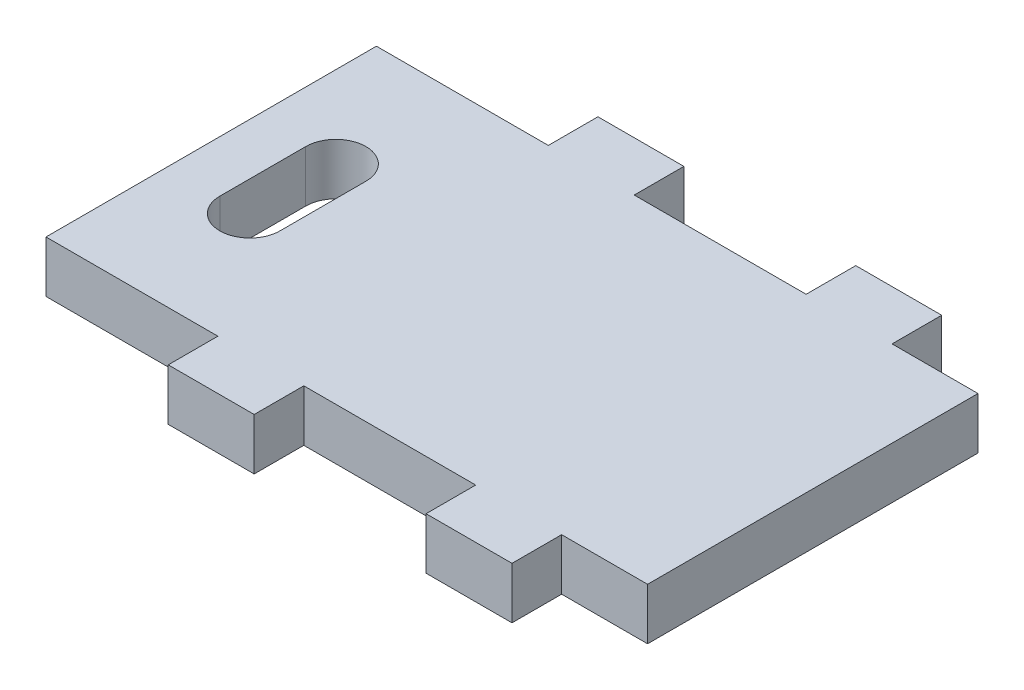
ISO-10303-21;
HEADER;
FILE_DESCRIPTION(('STEP AP214'),'2;1');
FILE_NAME('part.step','',(''),(''),'','','');
FILE_SCHEMA(('AUTOMOTIVE_DESIGN { 1 0 10303 214 1 1 1 1 }'));
ENDSEC;
DATA;
#1=APPLICATION_CONTEXT('core data for automotive mechanical design processes');
#2=APPLICATION_PROTOCOL_DEFINITION('international standard','automotive_design',2000,#1);
#3=PRODUCT_CONTEXT('',#1,'mechanical');
#4=PRODUCT('Part','Part','',(#3));
#5=PRODUCT_RELATED_PRODUCT_CATEGORY('part','',(#4));
#6=PRODUCT_DEFINITION_FORMATION('','',#4);
#7=PRODUCT_DEFINITION_CONTEXT('part definition',#1,'design');
#8=PRODUCT_DEFINITION('design','',#6,#7);
#9=PRODUCT_DEFINITION_SHAPE('','',#8);
#10=(LENGTH_UNIT() NAMED_UNIT(*) SI_UNIT(.MILLI.,.METRE.));
#11=(NAMED_UNIT(*) PLANE_ANGLE_UNIT() SI_UNIT($,.RADIAN.));
#12=(NAMED_UNIT(*) SI_UNIT($,.STERADIAN.) SOLID_ANGLE_UNIT());
#13=UNCERTAINTY_MEASURE_WITH_UNIT(LENGTH_MEASURE(1.E-05),#10,'distance_accuracy_value','');
#14=(GEOMETRIC_REPRESENTATION_CONTEXT(3) GLOBAL_UNCERTAINTY_ASSIGNED_CONTEXT((#13)) GLOBAL_UNIT_ASSIGNED_CONTEXT((#10,
#11,#12)) REPRESENTATION_CONTEXT('',''));
#15=CARTESIAN_POINT('',(0.,0.,0.));
#16=DIRECTION('',(0.,0.,1.));
#17=DIRECTION('',(1.,0.,0.));
#18=AXIS2_PLACEMENT_3D('',#15,#16,#17);
#19=CARTESIAN_POINT('',(35.,6.00000000000001,0.));
#20=DIRECTION('',(1.,0.,0.));
#21=DIRECTION('',(0.,0.,-1.));
#22=AXIS2_PLACEMENT_3D('',#19,#20,#21);
#23=PLANE('',#22);
#24=DIRECTION('',(0.,0.,1.));
#25=VECTOR('',#24,1.);
#26=CARTESIAN_POINT('',(35.,6.00000000000001,0.));
#27=LINE('',#26,#25);
#28=CARTESIAN_POINT('',(35.,6.00000000000001,-19.2243664677815));
#29=VERTEX_POINT('',#28);
#30=CARTESIAN_POINT('',(35.,6.00000000000001,19.2243664677815));
#31=VERTEX_POINT('',#30);
#32=EDGE_CURVE('E366',#29,#31,#27,.T.);
#33=ORIENTED_EDGE('',*,*,#32,.T.);
#34=DIRECTION('',(0.,1.,0.));
#35=VECTOR('',#34,1.);
#36=CARTESIAN_POINT('',(35.,0.,19.2243664677815));
#37=LINE('',#36,#35);
#38=CARTESIAN_POINT('',(35.,0.,19.2243664677815));
#39=VERTEX_POINT('',#38);
#40=EDGE_CURVE('E255',#39,#31,#37,.T.);
#41=ORIENTED_EDGE('',*,*,#40,.F.);
#42=DIRECTION('',(0.,0.,1.));
#43=VECTOR('',#42,1.);
#44=CARTESIAN_POINT('',(35.,0.,0.));
#45=LINE('',#44,#43);
#46=CARTESIAN_POINT('',(35.,0.,-19.2243664677815));
#47=VERTEX_POINT('',#46);
#48=EDGE_CURVE('E322',#47,#39,#45,.T.);
#49=ORIENTED_EDGE('',*,*,#48,.F.);
#50=DIRECTION('',(0.,1.,0.));
#51=VECTOR('',#50,1.);
#52=CARTESIAN_POINT('',(35.,0.,-19.2243664677815));
#53=LINE('',#52,#51);
#54=EDGE_CURVE('E319',#47,#29,#53,.T.);
#55=ORIENTED_EDGE('',*,*,#54,.T.);
#56=EDGE_LOOP('',(#33,#41,#49,#55));
#57=FACE_BOUND('',#56,.T.);
#58=ADVANCED_FACE('F39',(#57),#23,.T.);
#59=CARTESIAN_POINT('',(0.,6.00000000000001,25.));
#60=DIRECTION('',(0.,0.,-1.));
#61=DIRECTION('',(-1.,0.,0.));
#62=AXIS2_PLACEMENT_3D('',#59,#60,#61);
#63=PLANE('',#62);
#64=DIRECTION('',(0.,1.,0.));
#65=VECTOR('',#64,1.);
#66=CARTESIAN_POINT('',(25.,0.,25.));
#67=LINE('',#66,#65);
#68=CARTESIAN_POINT('',(25.,0.,25.));
#69=VERTEX_POINT('',#68);
#70=CARTESIAN_POINT('',(25.,6.00000000000001,25.));
#71=VERTEX_POINT('',#70);
#72=EDGE_CURVE('E262',#69,#71,#67,.T.);
#73=ORIENTED_EDGE('',*,*,#72,.T.);
#74=DIRECTION('',(1.,0.,0.));
#75=VECTOR('',#74,1.);
#76=CARTESIAN_POINT('',(0.,6.00000000000001,25.));
#77=LINE('',#76,#75);
#78=CARTESIAN_POINT('',(15.,6.00000000000001,25.));
#79=VERTEX_POINT('',#78);
#80=EDGE_CURVE('E47',#79,#71,#77,.T.);
#81=ORIENTED_EDGE('',*,*,#80,.F.);
#82=DIRECTION('',(0.,1.,0.));
#83=VECTOR('',#82,1.);
#84=CARTESIAN_POINT('',(15.,0.,25.));
#85=LINE('',#84,#83);
#86=CARTESIAN_POINT('',(15.,0.,25.));
#87=VERTEX_POINT('',#86);
#88=EDGE_CURVE('E259',#87,#79,#85,.T.);
#89=ORIENTED_EDGE('',*,*,#88,.F.);
#90=DIRECTION('',(1.,0.,0.));
#91=VECTOR('',#90,1.);
#92=CARTESIAN_POINT('',(0.,0.,25.));
#93=LINE('',#92,#91);
#94=EDGE_CURVE('E42',#87,#69,#93,.T.);
#95=ORIENTED_EDGE('',*,*,#94,.T.);
#96=EDGE_LOOP('',(#73,#81,#89,#95));
#97=FACE_BOUND('',#96,.T.);
#98=ADVANCED_FACE('F456',(#97),#63,.F.);
#99=DIRECTION('',(0.,1.,0.));
#100=VECTOR('',#99,1.);
#101=CARTESIAN_POINT('',(-5.,0.,25.));
#102=LINE('',#101,#100);
#103=CARTESIAN_POINT('',(-5.,0.,25.));
#104=VERTEX_POINT('',#103);
#105=CARTESIAN_POINT('',(-5.,6.00000000000001,25.));
#106=VERTEX_POINT('',#105);
#107=EDGE_CURVE('E288',#104,#106,#102,.T.);
#108=ORIENTED_EDGE('',*,*,#107,.T.);
#109=CARTESIAN_POINT('',(-15.,6.00000000000001,25.));
#110=VERTEX_POINT('',#109);
#111=EDGE_CURVE('E11',#110,#106,#77,.T.);
#112=ORIENTED_EDGE('',*,*,#111,.F.);
#113=DIRECTION('',(0.,1.,0.));
#114=VECTOR('',#113,1.);
#115=CARTESIAN_POINT('',(-15.,0.,25.));
#116=LINE('',#115,#114);
#117=CARTESIAN_POINT('',(-15.,0.,25.));
#118=VERTEX_POINT('',#117);
#119=EDGE_CURVE('E282',#118,#110,#116,.T.);
#120=ORIENTED_EDGE('',*,*,#119,.F.);
#121=EDGE_CURVE('E370',#118,#104,#93,.T.);
#122=ORIENTED_EDGE('',*,*,#121,.T.);
#123=EDGE_LOOP('',(#108,#112,#120,#122));
#124=FACE_BOUND('',#123,.T.);
#125=ADVANCED_FACE('F390',(#124),#63,.F.);
#126=CARTESIAN_POINT('',(0.,6.00000000000001,0.));
#127=DIRECTION('',(0.,1.,0.));
#128=DIRECTION('',(0.,0.,1.));
#129=AXIS2_PLACEMENT_3D('',#126,#127,#128);
#130=PLANE('',#129);
#131=DIRECTION('',(0.,0.,-1.));
#132=VECTOR('',#131,1.);
#133=CARTESIAN_POINT('',(-22.,6.00000000000001,0.));
#134=LINE('',#133,#132);
#135=CARTESIAN_POINT('',(-22.,6.00000000000001,5.));
#136=VERTEX_POINT('',#135);
#137=CARTESIAN_POINT('',(-22.,6.00000000000001,-5.));
#138=VERTEX_POINT('',#137);
#139=EDGE_CURVE('E55',#136,#138,#134,.T.);
#140=ORIENTED_EDGE('',*,*,#139,.F.);
#141=CARTESIAN_POINT('',(-25.5,6.00000000000001,5.));
#142=DIRECTION('',(0.,1.,0.));
#143=DIRECTION('',(0.,0.,1.));
#144=AXIS2_PLACEMENT_3D('',#141,#142,#143);
#145=CIRCLE('',#144,3.5);
#146=CARTESIAN_POINT('',(-29.,6.00000000000001,5.));
#147=VERTEX_POINT('',#146);
#148=EDGE_CURVE('E218',#147,#136,#145,.T.);
#149=ORIENTED_EDGE('',*,*,#148,.F.);
#150=DIRECTION('',(0.,0.,-1.));
#151=VECTOR('',#150,1.);
#152=CARTESIAN_POINT('',(-29.,6.00000000000001,0.));
#153=LINE('',#152,#151);
#154=CARTESIAN_POINT('',(-29.,6.00000000000001,-5.));
#155=VERTEX_POINT('',#154);
#156=EDGE_CURVE('E221',#147,#155,#153,.T.);
#157=ORIENTED_EDGE('',*,*,#156,.T.);
#158=CARTESIAN_POINT('',(-25.5,6.00000000000001,-5.));
#159=DIRECTION('',(0.,1.,0.));
#160=DIRECTION('',(0.,0.,1.));
#161=AXIS2_PLACEMENT_3D('',#158,#159,#160);
#162=CIRCLE('',#161,3.5);
#163=EDGE_CURVE('E227',#138,#155,#162,.T.);
#164=ORIENTED_EDGE('',*,*,#163,.F.);
#165=EDGE_LOOP('',(#140,#149,#157,#164));
#166=FACE_BOUND('',#165,.T.);
#167=ORIENTED_EDGE('',*,*,#80,.T.);
#168=DIRECTION('',(0.,0.,-1.));
#169=VECTOR('',#168,1.);
#170=CARTESIAN_POINT('',(25.,6.00000000000001,25.));
#171=LINE('',#170,#169);
#172=CARTESIAN_POINT('',(25.,6.00000000000001,19.2243664677815));
#173=VERTEX_POINT('',#172);
#174=EDGE_CURVE('E252',#71,#173,#171,.T.);
#175=ORIENTED_EDGE('',*,*,#174,.T.);
#176=DIRECTION('',(1.,0.,0.));
#177=VECTOR('',#176,1.);
#178=CARTESIAN_POINT('',(35.,6.00000000000001,19.2243664677815));
#179=LINE('',#178,#177);
#180=EDGE_CURVE('E256',#173,#31,#179,.T.);
#181=ORIENTED_EDGE('',*,*,#180,.T.);
#182=ORIENTED_EDGE('',*,*,#32,.F.);
#183=DIRECTION('',(1.,0.,0.));
#184=VECTOR('',#183,1.);
#185=CARTESIAN_POINT('',(35.,6.00000000000001,-19.2243664677815));
#186=LINE('',#185,#184);
#187=CARTESIAN_POINT('',(25.,6.00000000000001,-19.2243664677815));
#188=VERTEX_POINT('',#187);
#189=EDGE_CURVE('E310',#188,#29,#186,.T.);
#190=ORIENTED_EDGE('',*,*,#189,.F.);
#191=DIRECTION('',(0.,0.,1.));
#192=VECTOR('',#191,1.);
#193=CARTESIAN_POINT('',(25.,6.00000000000001,-25.));
#194=LINE('',#193,#192);
#195=CARTESIAN_POINT('',(25.,6.00000000000001,-25.));
#196=VERTEX_POINT('',#195);
#197=EDGE_CURVE('E314',#196,#188,#194,.T.);
#198=ORIENTED_EDGE('',*,*,#197,.F.);
#199=DIRECTION('',(1.,0.,0.));
#200=VECTOR('',#199,1.);
#201=CARTESIAN_POINT('',(0.,6.00000000000001,-25.));
#202=LINE('',#201,#200);
#203=CARTESIAN_POINT('',(15.,6.00000000000001,-25.));
#204=VERTEX_POINT('',#203);
#205=EDGE_CURVE('E369',#204,#196,#202,.T.);
#206=ORIENTED_EDGE('',*,*,#205,.F.);
#207=DIRECTION('',(0.,0.,-1.));
#208=VECTOR('',#207,1.);
#209=CARTESIAN_POINT('',(15.,6.00000000000001,-25.));
#210=LINE('',#209,#208);
#211=CARTESIAN_POINT('',(15.,6.00000000000001,-19.2243664677815));
#212=VERTEX_POINT('',#211);
#213=EDGE_CURVE('E317',#212,#204,#210,.T.);
#214=ORIENTED_EDGE('',*,*,#213,.F.);
#215=DIRECTION('',(1.,0.,0.));
#216=VECTOR('',#215,1.);
#217=CARTESIAN_POINT('',(15.,6.00000000000001,-19.2243664677815));
#218=LINE('',#217,#216);
#219=CARTESIAN_POINT('',(-5.,6.00000000000001,-19.2243664677815));
#220=VERTEX_POINT('',#219);
#221=EDGE_CURVE('E337',#220,#212,#218,.T.);
#222=ORIENTED_EDGE('',*,*,#221,.F.);
#223=DIRECTION('',(0.,0.,1.));
#224=VECTOR('',#223,1.);
#225=CARTESIAN_POINT('',(-5.,6.00000000000001,-25.));
#226=LINE('',#225,#224);
#227=CARTESIAN_POINT('',(-5.,6.00000000000001,-25.));
#228=VERTEX_POINT('',#227);
#229=EDGE_CURVE('E340',#228,#220,#226,.T.);
#230=ORIENTED_EDGE('',*,*,#229,.F.);
#231=CARTESIAN_POINT('',(-15.,6.00000000000001,-25.));
#232=VERTEX_POINT('',#231);
#233=EDGE_CURVE('E372',#232,#228,#202,.T.);
#234=ORIENTED_EDGE('',*,*,#233,.F.);
#235=DIRECTION('',(0.,0.,-1.));
#236=VECTOR('',#235,1.);
#237=CARTESIAN_POINT('',(-15.,6.00000000000001,-25.));
#238=LINE('',#237,#236);
#239=CARTESIAN_POINT('',(-15.,6.00000000000001,-19.2243664677815));
#240=VERTEX_POINT('',#239);
#241=EDGE_CURVE('E336',#240,#232,#238,.T.);
#242=ORIENTED_EDGE('',*,*,#241,.F.);
#243=DIRECTION('',(1.,0.,0.));
#244=VECTOR('',#243,1.);
#245=CARTESIAN_POINT('',(-25.,6.00000000000001,-19.2243664677815));
#246=LINE('',#245,#244);
#247=CARTESIAN_POINT('',(-35.,6.00000000000001,-19.2243664677815));
#248=VERTEX_POINT('',#247);
#249=EDGE_CURVE('E357',#248,#240,#246,.T.);
#250=ORIENTED_EDGE('',*,*,#249,.F.);
#251=DIRECTION('',(0.,0.,-1.));
#252=VECTOR('',#251,1.);
#253=CARTESIAN_POINT('',(-35.,6.00000000000001,19.2243664677815));
#254=LINE('',#253,#252);
#255=CARTESIAN_POINT('',(-35.,6.00000000000001,19.2243664677815));
#256=VERTEX_POINT('',#255);
#257=EDGE_CURVE('E233',#256,#248,#254,.T.);
#258=ORIENTED_EDGE('',*,*,#257,.F.);
#259=DIRECTION('',(1.,0.,0.));
#260=VECTOR('',#259,1.);
#261=CARTESIAN_POINT('',(-25.,6.00000000000001,19.2243664677815));
#262=LINE('',#261,#260);
#263=CARTESIAN_POINT('',(-15.,6.00000000000001,19.2243664677815));
#264=VERTEX_POINT('',#263);
#265=EDGE_CURVE('E297',#256,#264,#262,.T.);
#266=ORIENTED_EDGE('',*,*,#265,.T.);
#267=DIRECTION('',(0.,0.,1.));
#268=VECTOR('',#267,1.);
#269=CARTESIAN_POINT('',(-15.,6.00000000000001,25.));
#270=LINE('',#269,#268);
#271=EDGE_CURVE('E240',#264,#110,#270,.T.);
#272=ORIENTED_EDGE('',*,*,#271,.T.);
#273=ORIENTED_EDGE('',*,*,#111,.T.);
#274=DIRECTION('',(0.,0.,-1.));
#275=VECTOR('',#274,1.);
#276=CARTESIAN_POINT('',(-5.,6.00000000000001,25.));
#277=LINE('',#276,#275);
#278=CARTESIAN_POINT('',(-5.,6.00000000000001,19.2243664677815));
#279=VERTEX_POINT('',#278);
#280=EDGE_CURVE('E272',#106,#279,#277,.T.);
#281=ORIENTED_EDGE('',*,*,#280,.T.);
#282=DIRECTION('',(1.,0.,0.));
#283=VECTOR('',#282,1.);
#284=CARTESIAN_POINT('',(15.,6.00000000000001,19.2243664677815));
#285=LINE('',#284,#283);
#286=CARTESIAN_POINT('',(15.,6.00000000000001,19.2243664677815));
#287=VERTEX_POINT('',#286);
#288=EDGE_CURVE('E281',#279,#287,#285,.T.);
#289=ORIENTED_EDGE('',*,*,#288,.T.);
#290=DIRECTION('',(0.,0.,1.));
#291=VECTOR('',#290,1.);
#292=CARTESIAN_POINT('',(15.,6.00000000000001,25.));
#293=LINE('',#292,#291);
#294=EDGE_CURVE('E278',#287,#79,#293,.T.);
#295=ORIENTED_EDGE('',*,*,#294,.T.);
#296=EDGE_LOOP('',(#167,#175,#181,#182,#190,#198,#206,#214,#222,#230,#234,#242,#250,#258,#266,
#272,#273,#281,#289,#295));
#297=FACE_BOUND('',#296,.T.);
#298=ADVANCED_FACE('F401',(#166,#297),#130,.T.);
#299=CARTESIAN_POINT('',(0.,0.,0.));
#300=DIRECTION('',(0.,1.,0.));
#301=DIRECTION('',(0.,0.,1.));
#302=AXIS2_PLACEMENT_3D('',#299,#300,#301);
#303=PLANE('',#302);
#304=CARTESIAN_POINT('',(-25.5,0.,5.));
#305=DIRECTION('',(0.,1.,0.));
#306=DIRECTION('',(0.,0.,1.));
#307=AXIS2_PLACEMENT_3D('',#304,#305,#306);
#308=CIRCLE('',#307,3.5);
#309=CARTESIAN_POINT('',(-29.,0.,5.));
#310=VERTEX_POINT('',#309);
#311=CARTESIAN_POINT('',(-22.,0.,5.));
#312=VERTEX_POINT('',#311);
#313=EDGE_CURVE('E206',#310,#312,#308,.T.);
#314=ORIENTED_EDGE('',*,*,#313,.T.);
#315=DIRECTION('',(0.,0.,-1.));
#316=VECTOR('',#315,1.);
#317=CARTESIAN_POINT('',(-22.,0.,0.));
#318=LINE('',#317,#316);
#319=CARTESIAN_POINT('',(-22.,0.,-5.));
#320=VERTEX_POINT('',#319);
#321=EDGE_CURVE('E203',#312,#320,#318,.T.);
#322=ORIENTED_EDGE('',*,*,#321,.T.);
#323=CARTESIAN_POINT('',(-25.5,0.,-5.));
#324=DIRECTION('',(0.,1.,0.));
#325=DIRECTION('',(0.,0.,1.));
#326=AXIS2_PLACEMENT_3D('',#323,#324,#325);
#327=CIRCLE('',#326,3.5);
#328=CARTESIAN_POINT('',(-29.,0.,-5.));
#329=VERTEX_POINT('',#328);
#330=EDGE_CURVE('E209',#320,#329,#327,.T.);
#331=ORIENTED_EDGE('',*,*,#330,.T.);
#332=DIRECTION('',(0.,0.,-1.));
#333=VECTOR('',#332,1.);
#334=CARTESIAN_POINT('',(-29.,0.,0.));
#335=LINE('',#334,#333);
#336=EDGE_CURVE('E213',#310,#329,#335,.T.);
#337=ORIENTED_EDGE('',*,*,#336,.F.);
#338=EDGE_LOOP('',(#314,#322,#331,#337));
#339=FACE_BOUND('',#338,.T.);
#340=DIRECTION('',(0.,0.,-1.));
#341=VECTOR('',#340,1.);
#342=CARTESIAN_POINT('',(25.,0.,25.));
#343=LINE('',#342,#341);
#344=CARTESIAN_POINT('',(25.,0.,19.2243664677815));
#345=VERTEX_POINT('',#344);
#346=EDGE_CURVE('E251',#69,#345,#343,.T.);
#347=ORIENTED_EDGE('',*,*,#346,.F.);
#348=ORIENTED_EDGE('',*,*,#94,.F.);
#349=DIRECTION('',(0.,0.,1.));
#350=VECTOR('',#349,1.);
#351=CARTESIAN_POINT('',(15.,0.,25.));
#352=LINE('',#351,#350);
#353=CARTESIAN_POINT('',(15.,0.,19.2243664677815));
#354=VERTEX_POINT('',#353);
#355=EDGE_CURVE('E269',#354,#87,#352,.T.);
#356=ORIENTED_EDGE('',*,*,#355,.F.);
#357=DIRECTION('',(1.,0.,0.));
#358=VECTOR('',#357,1.);
#359=CARTESIAN_POINT('',(15.,0.,19.2243664677815));
#360=LINE('',#359,#358);
#361=CARTESIAN_POINT('',(-5.,0.,19.2243664677815));
#362=VERTEX_POINT('',#361);
#363=EDGE_CURVE('E271',#362,#354,#360,.T.);
#364=ORIENTED_EDGE('',*,*,#363,.F.);
#365=DIRECTION('',(0.,0.,-1.));
#366=VECTOR('',#365,1.);
#367=CARTESIAN_POINT('',(-5.,0.,25.));
#368=LINE('',#367,#366);
#369=EDGE_CURVE('E274',#104,#362,#368,.T.);
#370=ORIENTED_EDGE('',*,*,#369,.F.);
#371=ORIENTED_EDGE('',*,*,#121,.F.);
#372=DIRECTION('',(0.,0.,1.));
#373=VECTOR('',#372,1.);
#374=CARTESIAN_POINT('',(-15.,0.,25.));
#375=LINE('',#374,#373);
#376=CARTESIAN_POINT('',(-15.,0.,19.2243664677815));
#377=VERTEX_POINT('',#376);
#378=EDGE_CURVE('E294',#377,#118,#375,.T.);
#379=ORIENTED_EDGE('',*,*,#378,.F.);
#380=DIRECTION('',(1.,0.,0.));
#381=VECTOR('',#380,1.);
#382=CARTESIAN_POINT('',(-25.,0.,19.2243664677815));
#383=LINE('',#382,#381);
#384=CARTESIAN_POINT('',(-35.,0.,19.2243664677815));
#385=VERTEX_POINT('',#384);
#386=EDGE_CURVE('E296',#385,#377,#383,.T.);
#387=ORIENTED_EDGE('',*,*,#386,.F.);
#388=DIRECTION('',(0.,0.,1.));
#389=VECTOR('',#388,1.);
#390=CARTESIAN_POINT('',(-35.,0.,19.2243664677815));
#391=LINE('',#390,#389);
#392=CARTESIAN_POINT('',(-35.,0.,-19.2243664677815));
#393=VERTEX_POINT('',#392);
#394=EDGE_CURVE('E237',#393,#385,#391,.T.);
#395=ORIENTED_EDGE('',*,*,#394,.F.);
#396=DIRECTION('',(1.,0.,0.));
#397=VECTOR('',#396,1.);
#398=CARTESIAN_POINT('',(-25.,0.,-19.2243664677815));
#399=LINE('',#398,#397);
#400=CARTESIAN_POINT('',(-15.,0.,-19.2243664677815));
#401=VERTEX_POINT('',#400);
#402=EDGE_CURVE('E355',#393,#401,#399,.T.);
#403=ORIENTED_EDGE('',*,*,#402,.T.);
#404=DIRECTION('',(0.,0.,-1.));
#405=VECTOR('',#404,1.);
#406=CARTESIAN_POINT('',(-15.,0.,-25.));
#407=LINE('',#406,#405);
#408=CARTESIAN_POINT('',(-15.,0.,-25.));
#409=VERTEX_POINT('',#408);
#410=EDGE_CURVE('E360',#401,#409,#407,.T.);
#411=ORIENTED_EDGE('',*,*,#410,.T.);
#412=DIRECTION('',(1.,0.,0.));
#413=VECTOR('',#412,1.);
#414=CARTESIAN_POINT('',(0.,0.,-25.));
#415=LINE('',#414,#413);
#416=CARTESIAN_POINT('',(-5.,0.,-25.));
#417=VERTEX_POINT('',#416);
#418=EDGE_CURVE('E378',#409,#417,#415,.T.);
#419=ORIENTED_EDGE('',*,*,#418,.T.);
#420=DIRECTION('',(0.,0.,1.));
#421=VECTOR('',#420,1.);
#422=CARTESIAN_POINT('',(-5.,0.,-25.));
#423=LINE('',#422,#421);
#424=CARTESIAN_POINT('',(-5.,0.,-19.2243664677815));
#425=VERTEX_POINT('',#424);
#426=EDGE_CURVE('E347',#417,#425,#423,.T.);
#427=ORIENTED_EDGE('',*,*,#426,.T.);
#428=DIRECTION('',(1.,0.,0.));
#429=VECTOR('',#428,1.);
#430=CARTESIAN_POINT('',(15.,0.,-19.2243664677815));
#431=LINE('',#430,#429);
#432=CARTESIAN_POINT('',(15.,0.,-19.2243664677815));
#433=VERTEX_POINT('',#432);
#434=EDGE_CURVE('E329',#425,#433,#431,.T.);
#435=ORIENTED_EDGE('',*,*,#434,.T.);
#436=DIRECTION('',(0.,0.,-1.));
#437=VECTOR('',#436,1.);
#438=CARTESIAN_POINT('',(15.,0.,-25.));
#439=LINE('',#438,#437);
#440=CARTESIAN_POINT('',(15.,0.,-25.));
#441=VERTEX_POINT('',#440);
#442=EDGE_CURVE('E341',#433,#441,#439,.T.);
#443=ORIENTED_EDGE('',*,*,#442,.T.);
#444=CARTESIAN_POINT('',(25.,0.,-25.));
#445=VERTEX_POINT('',#444);
#446=EDGE_CURVE('E376',#441,#445,#415,.T.);
#447=ORIENTED_EDGE('',*,*,#446,.T.);
#448=DIRECTION('',(0.,0.,1.));
#449=VECTOR('',#448,1.);
#450=CARTESIAN_POINT('',(25.,0.,-25.));
#451=LINE('',#450,#449);
#452=CARTESIAN_POINT('',(25.,0.,-19.2243664677815));
#453=VERTEX_POINT('',#452);
#454=EDGE_CURVE('E306',#445,#453,#451,.T.);
#455=ORIENTED_EDGE('',*,*,#454,.T.);
#456=DIRECTION('',(1.,0.,0.));
#457=VECTOR('',#456,1.);
#458=CARTESIAN_POINT('',(35.,0.,-19.2243664677815));
#459=LINE('',#458,#457);
#460=EDGE_CURVE('E309',#453,#47,#459,.T.);
#461=ORIENTED_EDGE('',*,*,#460,.T.);
#462=ORIENTED_EDGE('',*,*,#48,.T.);
#463=DIRECTION('',(1.,0.,0.));
#464=VECTOR('',#463,1.);
#465=CARTESIAN_POINT('',(35.,0.,19.2243664677815));
#466=LINE('',#465,#464);
#467=EDGE_CURVE('E249',#345,#39,#466,.T.);
#468=ORIENTED_EDGE('',*,*,#467,.F.);
#469=EDGE_LOOP('',(#347,#348,#356,#364,#370,#371,#379,#387,#395,#403,#411,#419,#427,#435,#443,
#447,#455,#461,#462,#468));
#470=FACE_BOUND('',#469,.T.);
#471=ADVANCED_FACE('F215',(#339,#470),#303,.F.);
#472=CARTESIAN_POINT('',(0.,6.00000000000001,-25.));
#473=DIRECTION('',(0.,0.,-1.));
#474=DIRECTION('',(-1.,0.,0.));
#475=AXIS2_PLACEMENT_3D('',#472,#473,#474);
#476=PLANE('',#475);
#477=DIRECTION('',(0.,1.,0.));
#478=VECTOR('',#477,1.);
#479=CARTESIAN_POINT('',(25.,0.,-25.));
#480=LINE('',#479,#478);
#481=EDGE_CURVE('E313',#445,#196,#480,.T.);
#482=ORIENTED_EDGE('',*,*,#481,.F.);
#483=ORIENTED_EDGE('',*,*,#446,.F.);
#484=DIRECTION('',(0.,1.,0.));
#485=VECTOR('',#484,1.);
#486=CARTESIAN_POINT('',(15.,0.,-25.));
#487=LINE('',#486,#485);
#488=EDGE_CURVE('E326',#441,#204,#487,.T.);
#489=ORIENTED_EDGE('',*,*,#488,.T.);
#490=ORIENTED_EDGE('',*,*,#205,.T.);
#491=EDGE_LOOP('',(#482,#483,#489,#490));
#492=FACE_BOUND('',#491,.T.);
#493=ADVANCED_FACE('F437',(#492),#476,.T.);
#494=DIRECTION('',(0.,1.,0.));
#495=VECTOR('',#494,1.);
#496=CARTESIAN_POINT('',(-5.,0.,-25.));
#497=LINE('',#496,#495);
#498=EDGE_CURVE('E330',#417,#228,#497,.T.);
#499=ORIENTED_EDGE('',*,*,#498,.F.);
#500=ORIENTED_EDGE('',*,*,#418,.F.);
#501=DIRECTION('',(0.,1.,0.));
#502=VECTOR('',#501,1.);
#503=CARTESIAN_POINT('',(-15.,0.,-25.));
#504=LINE('',#503,#502);
#505=EDGE_CURVE('E352',#409,#232,#504,.T.);
#506=ORIENTED_EDGE('',*,*,#505,.T.);
#507=ORIENTED_EDGE('',*,*,#233,.T.);
#508=EDGE_LOOP('',(#499,#500,#506,#507));
#509=FACE_BOUND('',#508,.T.);
#510=ADVANCED_FACE('F421',(#509),#476,.T.);
#511=CARTESIAN_POINT('',(-15.,0.,-25.));
#512=DIRECTION('',(1.,0.,0.));
#513=DIRECTION('',(0.,0.,-1.));
#514=AXIS2_PLACEMENT_3D('',#511,#512,#513);
#515=PLANE('',#514);
#516=ORIENTED_EDGE('',*,*,#241,.T.);
#517=ORIENTED_EDGE('',*,*,#505,.F.);
#518=ORIENTED_EDGE('',*,*,#410,.F.);
#519=DIRECTION('',(0.,1.,0.));
#520=VECTOR('',#519,1.);
#521=CARTESIAN_POINT('',(-15.,0.,-19.2243664677815));
#522=LINE('',#521,#520);
#523=EDGE_CURVE('E265',#401,#240,#522,.T.);
#524=ORIENTED_EDGE('',*,*,#523,.T.);
#525=EDGE_LOOP('',(#516,#517,#518,#524));
#526=FACE_BOUND('',#525,.T.);
#527=ADVANCED_FACE('F483',(#526),#515,.F.);
#528=CARTESIAN_POINT('',(-25.,0.,-19.2243664677815));
#529=DIRECTION('',(0.,0.,1.));
#530=DIRECTION('',(1.,0.,0.));
#531=AXIS2_PLACEMENT_3D('',#528,#529,#530);
#532=PLANE('',#531);
#533=ORIENTED_EDGE('',*,*,#249,.T.);
#534=ORIENTED_EDGE('',*,*,#523,.F.);
#535=ORIENTED_EDGE('',*,*,#402,.F.);
#536=DIRECTION('',(0.,1.,0.));
#537=VECTOR('',#536,1.);
#538=CARTESIAN_POINT('',(-35.,-39.7278877408585,-19.2243664677815));
#539=LINE('',#538,#537);
#540=EDGE_CURVE('E244',#393,#248,#539,.T.);
#541=ORIENTED_EDGE('',*,*,#540,.T.);
#542=EDGE_LOOP('',(#533,#534,#535,#541));
#543=FACE_BOUND('',#542,.T.);
#544=ADVANCED_FACE('F415',(#543),#532,.F.);
#545=CARTESIAN_POINT('',(15.,0.,-25.));
#546=DIRECTION('',(1.,0.,0.));
#547=DIRECTION('',(0.,0.,-1.));
#548=AXIS2_PLACEMENT_3D('',#545,#546,#547);
#549=PLANE('',#548);
#550=ORIENTED_EDGE('',*,*,#213,.T.);
#551=ORIENTED_EDGE('',*,*,#488,.F.);
#552=ORIENTED_EDGE('',*,*,#442,.F.);
#553=DIRECTION('',(0.,1.,0.));
#554=VECTOR('',#553,1.);
#555=CARTESIAN_POINT('',(15.,0.,-19.2243664677815));
#556=LINE('',#555,#554);
#557=EDGE_CURVE('E334',#433,#212,#556,.T.);
#558=ORIENTED_EDGE('',*,*,#557,.T.);
#559=EDGE_LOOP('',(#550,#551,#552,#558));
#560=FACE_BOUND('',#559,.T.);
#561=ADVANCED_FACE('F500',(#560),#549,.F.);
#562=CARTESIAN_POINT('',(15.,0.,-19.2243664677815));
#563=DIRECTION('',(0.,0.,1.));
#564=DIRECTION('',(1.,0.,0.));
#565=AXIS2_PLACEMENT_3D('',#562,#563,#564);
#566=PLANE('',#565);
#567=ORIENTED_EDGE('',*,*,#221,.T.);
#568=ORIENTED_EDGE('',*,*,#557,.F.);
#569=ORIENTED_EDGE('',*,*,#434,.F.);
#570=DIRECTION('',(0.,1.,0.));
#571=VECTOR('',#570,1.);
#572=CARTESIAN_POINT('',(-5.,0.,-19.2243664677815));
#573=LINE('',#572,#571);
#574=EDGE_CURVE('E332',#425,#220,#573,.T.);
#575=ORIENTED_EDGE('',*,*,#574,.T.);
#576=EDGE_LOOP('',(#567,#568,#569,#575));
#577=FACE_BOUND('',#576,.T.);
#578=ADVANCED_FACE('F432',(#577),#566,.F.);
#579=CARTESIAN_POINT('',(-5.,0.,-25.));
#580=DIRECTION('',(-1.,0.,0.));
#581=DIRECTION('',(0.,0.,1.));
#582=AXIS2_PLACEMENT_3D('',#579,#580,#581);
#583=PLANE('',#582);
#584=ORIENTED_EDGE('',*,*,#229,.T.);
#585=ORIENTED_EDGE('',*,*,#574,.F.);
#586=ORIENTED_EDGE('',*,*,#426,.F.);
#587=ORIENTED_EDGE('',*,*,#498,.T.);
#588=EDGE_LOOP('',(#584,#585,#586,#587));
#589=FACE_BOUND('',#588,.T.);
#590=ADVANCED_FACE('F426',(#589),#583,.F.);
#591=CARTESIAN_POINT('',(35.,0.,-19.2243664677815));
#592=DIRECTION('',(0.,0.,1.));
#593=DIRECTION('',(1.,0.,0.));
#594=AXIS2_PLACEMENT_3D('',#591,#592,#593);
#595=PLANE('',#594);
#596=ORIENTED_EDGE('',*,*,#189,.T.);
#597=ORIENTED_EDGE('',*,*,#54,.F.);
#598=ORIENTED_EDGE('',*,*,#460,.F.);
#599=DIRECTION('',(0.,1.,0.));
#600=VECTOR('',#599,1.);
#601=CARTESIAN_POINT('',(25.,0.,-19.2243664677815));
#602=LINE('',#601,#600);
#603=EDGE_CURVE('E323',#453,#188,#602,.T.);
#604=ORIENTED_EDGE('',*,*,#603,.T.);
#605=EDGE_LOOP('',(#596,#597,#598,#604));
#606=FACE_BOUND('',#605,.T.);
#607=ADVANCED_FACE('F445',(#606),#595,.F.);
#608=CARTESIAN_POINT('',(25.,0.,-25.));
#609=DIRECTION('',(-1.,0.,0.));
#610=DIRECTION('',(0.,0.,1.));
#611=AXIS2_PLACEMENT_3D('',#608,#609,#610);
#612=PLANE('',#611);
#613=ORIENTED_EDGE('',*,*,#197,.T.);
#614=ORIENTED_EDGE('',*,*,#603,.F.);
#615=ORIENTED_EDGE('',*,*,#454,.F.);
#616=ORIENTED_EDGE('',*,*,#481,.T.);
#617=EDGE_LOOP('',(#613,#614,#615,#616));
#618=FACE_BOUND('',#617,.T.);
#619=ADVANCED_FACE('F440',(#618),#612,.F.);
#620=CARTESIAN_POINT('',(-15.,0.,25.));
#621=DIRECTION('',(-1.,0.,0.));
#622=DIRECTION('',(0.,0.,1.));
#623=AXIS2_PLACEMENT_3D('',#620,#621,#622);
#624=PLANE('',#623);
#625=ORIENTED_EDGE('',*,*,#271,.F.);
#626=DIRECTION('',(0.,1.,0.));
#627=VECTOR('',#626,1.);
#628=CARTESIAN_POINT('',(-15.,0.,19.2243664677815));
#629=LINE('',#628,#627);
#630=EDGE_CURVE('E299',#377,#264,#629,.T.);
#631=ORIENTED_EDGE('',*,*,#630,.F.);
#632=ORIENTED_EDGE('',*,*,#378,.T.);
#633=ORIENTED_EDGE('',*,*,#119,.T.);
#634=EDGE_LOOP('',(#625,#631,#632,#633));
#635=FACE_BOUND('',#634,.T.);
#636=ADVANCED_FACE('F406',(#635),#624,.T.);
#637=CARTESIAN_POINT('',(-25.,0.,19.2243664677815));
#638=DIRECTION('',(0.,0.,1.));
#639=DIRECTION('',(1.,0.,0.));
#640=AXIS2_PLACEMENT_3D('',#637,#638,#639);
#641=PLANE('',#640);
#642=ORIENTED_EDGE('',*,*,#265,.F.);
#643=DIRECTION('',(0.,1.,0.));
#644=VECTOR('',#643,1.);
#645=CARTESIAN_POINT('',(-35.,-39.7278877408585,19.2243664677815));
#646=LINE('',#645,#644);
#647=EDGE_CURVE('E241',#385,#256,#646,.T.);
#648=ORIENTED_EDGE('',*,*,#647,.F.);
#649=ORIENTED_EDGE('',*,*,#386,.T.);
#650=ORIENTED_EDGE('',*,*,#630,.T.);
#651=EDGE_LOOP('',(#642,#648,#649,#650));
#652=FACE_BOUND('',#651,.T.);
#653=ADVANCED_FACE('F408',(#652),#641,.T.);
#654=CARTESIAN_POINT('',(15.,0.,25.));
#655=DIRECTION('',(-1.,0.,0.));
#656=DIRECTION('',(0.,0.,1.));
#657=AXIS2_PLACEMENT_3D('',#654,#655,#656);
#658=PLANE('',#657);
#659=ORIENTED_EDGE('',*,*,#294,.F.);
#660=DIRECTION('',(0.,1.,0.));
#661=VECTOR('',#660,1.);
#662=CARTESIAN_POINT('',(15.,0.,19.2243664677815));
#663=LINE('',#662,#661);
#664=EDGE_CURVE('E277',#354,#287,#663,.T.);
#665=ORIENTED_EDGE('',*,*,#664,.F.);
#666=ORIENTED_EDGE('',*,*,#355,.T.);
#667=ORIENTED_EDGE('',*,*,#88,.T.);
#668=EDGE_LOOP('',(#659,#665,#666,#667));
#669=FACE_BOUND('',#668,.T.);
#670=ADVANCED_FACE('F460',(#669),#658,.T.);
#671=CARTESIAN_POINT('',(-5.,0.,25.));
#672=DIRECTION('',(1.,0.,0.));
#673=DIRECTION('',(0.,0.,-1.));
#674=AXIS2_PLACEMENT_3D('',#671,#672,#673);
#675=PLANE('',#674);
#676=ORIENTED_EDGE('',*,*,#280,.F.);
#677=ORIENTED_EDGE('',*,*,#107,.F.);
#678=ORIENTED_EDGE('',*,*,#369,.T.);
#679=DIRECTION('',(0.,1.,0.));
#680=VECTOR('',#679,1.);
#681=CARTESIAN_POINT('',(-5.,0.,19.2243664677815));
#682=LINE('',#681,#680);
#683=EDGE_CURVE('E291',#362,#279,#682,.T.);
#684=ORIENTED_EDGE('',*,*,#683,.T.);
#685=EDGE_LOOP('',(#676,#677,#678,#684));
#686=FACE_BOUND('',#685,.T.);
#687=ADVANCED_FACE('F398',(#686),#675,.T.);
#688=CARTESIAN_POINT('',(15.,0.,19.2243664677815));
#689=DIRECTION('',(0.,0.,1.));
#690=DIRECTION('',(1.,0.,0.));
#691=AXIS2_PLACEMENT_3D('',#688,#689,#690);
#692=PLANE('',#691);
#693=ORIENTED_EDGE('',*,*,#288,.F.);
#694=ORIENTED_EDGE('',*,*,#683,.F.);
#695=ORIENTED_EDGE('',*,*,#363,.T.);
#696=ORIENTED_EDGE('',*,*,#664,.T.);
#697=EDGE_LOOP('',(#693,#694,#695,#696));
#698=FACE_BOUND('',#697,.T.);
#699=ADVANCED_FACE('F462',(#698),#692,.T.);
#700=CARTESIAN_POINT('',(25.,0.,25.));
#701=DIRECTION('',(1.,0.,0.));
#702=DIRECTION('',(0.,0.,-1.));
#703=AXIS2_PLACEMENT_3D('',#700,#701,#702);
#704=PLANE('',#703);
#705=ORIENTED_EDGE('',*,*,#174,.F.);
#706=ORIENTED_EDGE('',*,*,#72,.F.);
#707=ORIENTED_EDGE('',*,*,#346,.T.);
#708=DIRECTION('',(0.,1.,0.));
#709=VECTOR('',#708,1.);
#710=CARTESIAN_POINT('',(25.,0.,19.2243664677815));
#711=LINE('',#710,#709);
#712=EDGE_CURVE('E266',#345,#173,#711,.T.);
#713=ORIENTED_EDGE('',*,*,#712,.T.);
#714=EDGE_LOOP('',(#705,#706,#707,#713));
#715=FACE_BOUND('',#714,.T.);
#716=ADVANCED_FACE('F454',(#715),#704,.T.);
#717=CARTESIAN_POINT('',(35.,0.,19.2243664677815));
#718=DIRECTION('',(0.,0.,1.));
#719=DIRECTION('',(1.,0.,0.));
#720=AXIS2_PLACEMENT_3D('',#717,#718,#719);
#721=PLANE('',#720);
#722=ORIENTED_EDGE('',*,*,#180,.F.);
#723=ORIENTED_EDGE('',*,*,#712,.F.);
#724=ORIENTED_EDGE('',*,*,#467,.T.);
#725=ORIENTED_EDGE('',*,*,#40,.T.);
#726=EDGE_LOOP('',(#722,#723,#724,#725));
#727=FACE_BOUND('',#726,.T.);
#728=ADVANCED_FACE('F452',(#727),#721,.T.);
#729=CARTESIAN_POINT('',(-35.,-39.7278877408585,19.2243664677815));
#730=DIRECTION('',(1.,0.,0.));
#731=DIRECTION('',(0.,0.,-1.));
#732=AXIS2_PLACEMENT_3D('',#729,#730,#731);
#733=PLANE('',#732);
#734=ORIENTED_EDGE('',*,*,#540,.F.);
#735=ORIENTED_EDGE('',*,*,#394,.T.);
#736=ORIENTED_EDGE('',*,*,#647,.T.);
#737=ORIENTED_EDGE('',*,*,#257,.T.);
#738=EDGE_LOOP('',(#734,#735,#736,#737));
#739=FACE_BOUND('',#738,.T.);
#740=ADVANCED_FACE('F413',(#739),#733,.F.);
#741=CARTESIAN_POINT('',(-22.,0.,0.));
#742=DIRECTION('',(1.,0.,0.));
#743=DIRECTION('',(0.,0.,-1.));
#744=AXIS2_PLACEMENT_3D('',#741,#742,#743);
#745=PLANE('',#744);
#746=ORIENTED_EDGE('',*,*,#139,.T.);
#747=DIRECTION('',(0.,1.,0.));
#748=VECTOR('',#747,1.);
#749=CARTESIAN_POINT('',(-22.,0.,-5.));
#750=LINE('',#749,#748);
#751=EDGE_CURVE('E200',#320,#138,#750,.T.);
#752=ORIENTED_EDGE('',*,*,#751,.F.);
#753=ORIENTED_EDGE('',*,*,#321,.F.);
#754=DIRECTION('',(0.,1.,0.));
#755=VECTOR('',#754,1.);
#756=CARTESIAN_POINT('',(-22.,0.,5.));
#757=LINE('',#756,#755);
#758=EDGE_CURVE('E231',#312,#136,#757,.T.);
#759=ORIENTED_EDGE('',*,*,#758,.T.);
#760=EDGE_LOOP('',(#746,#752,#753,#759));
#761=FACE_BOUND('',#760,.T.);
#762=ADVANCED_FACE('F201',(#761),#745,.F.);
#763=CARTESIAN_POINT('',(-25.5,0.,5.));
#764=DIRECTION('',(0.,1.,0.));
#765=DIRECTION('',(0.,0.,1.));
#766=AXIS2_PLACEMENT_3D('',#763,#764,#765);
#767=CYLINDRICAL_SURFACE('',#766,3.5);
#768=ORIENTED_EDGE('',*,*,#148,.T.);
#769=ORIENTED_EDGE('',*,*,#758,.F.);
#770=ORIENTED_EDGE('',*,*,#313,.F.);
#771=DIRECTION('',(0.,1.,0.));
#772=VECTOR('',#771,1.);
#773=CARTESIAN_POINT('',(-29.,0.,5.));
#774=LINE('',#773,#772);
#775=EDGE_CURVE('E234',#310,#147,#774,.T.);
#776=ORIENTED_EDGE('',*,*,#775,.T.);
#777=EDGE_LOOP('',(#768,#769,#770,#776));
#778=FACE_BOUND('',#777,.T.);
#779=ADVANCED_FACE('F587',(#778),#767,.F.);
#780=CARTESIAN_POINT('',(-29.,0.,0.));
#781=DIRECTION('',(1.,0.,0.));
#782=DIRECTION('',(0.,0.,-1.));
#783=AXIS2_PLACEMENT_3D('',#780,#781,#782);
#784=PLANE('',#783);
#785=ORIENTED_EDGE('',*,*,#156,.F.);
#786=ORIENTED_EDGE('',*,*,#775,.F.);
#787=ORIENTED_EDGE('',*,*,#336,.T.);
#788=DIRECTION('',(0.,1.,0.));
#789=VECTOR('',#788,1.);
#790=CARTESIAN_POINT('',(-29.,0.,-5.));
#791=LINE('',#790,#789);
#792=EDGE_CURVE('E63',#329,#155,#791,.T.);
#793=ORIENTED_EDGE('',*,*,#792,.T.);
#794=EDGE_LOOP('',(#785,#786,#787,#793));
#795=FACE_BOUND('',#794,.T.);
#796=ADVANCED_FACE('F597',(#795),#784,.T.);
#797=CARTESIAN_POINT('',(-25.5,0.,-5.));
#798=DIRECTION('',(0.,1.,0.));
#799=DIRECTION('',(0.,0.,1.));
#800=AXIS2_PLACEMENT_3D('',#797,#798,#799);
#801=CYLINDRICAL_SURFACE('',#800,3.5);
#802=ORIENTED_EDGE('',*,*,#163,.T.);
#803=ORIENTED_EDGE('',*,*,#792,.F.);
#804=ORIENTED_EDGE('',*,*,#330,.F.);
#805=ORIENTED_EDGE('',*,*,#751,.T.);
#806=EDGE_LOOP('',(#802,#803,#804,#805));
#807=FACE_BOUND('',#806,.T.);
#808=ADVANCED_FACE('F210',(#807),#801,.F.);
#809=CLOSED_SHELL('',(#58,#98,#125,#298,#471,#493,#510,#527,#544,#561,#578,#590,#607,#619,#636,
#653,#670,#687,#699,#716,#728,#740,#762,#779,#796,#808));
#810=MANIFOLD_SOLID_BREP('B2',#809);
#811=ADVANCED_BREP_SHAPE_REPRESENTATION('',(#18,#810),#14);
#812=SHAPE_DEFINITION_REPRESENTATION(#9,#811);
ENDSEC;
END-ISO-10303-21;
